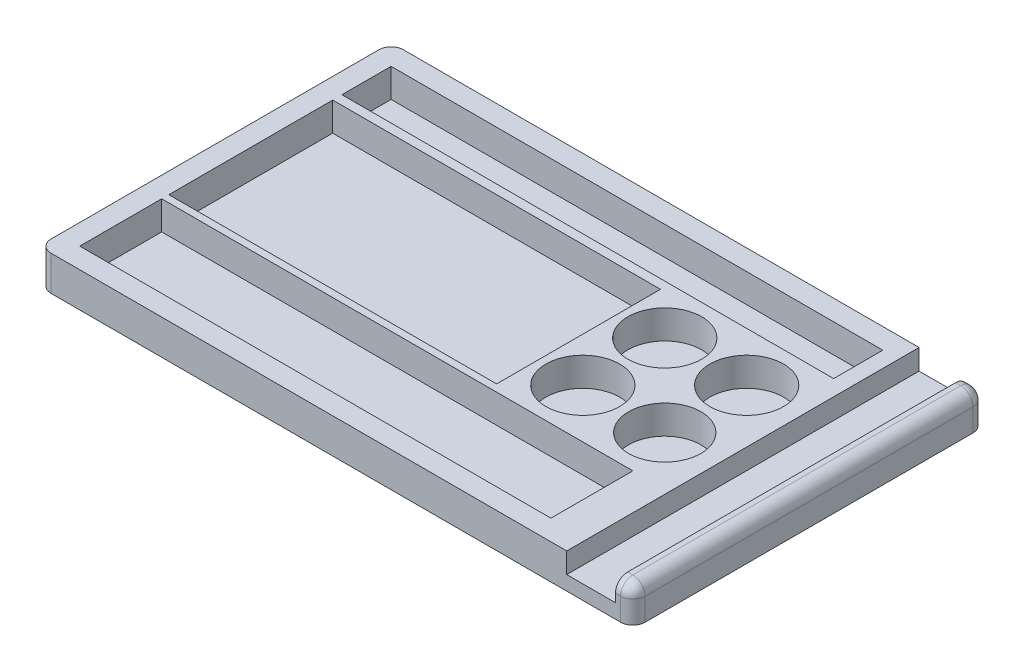
ISO-10303-21;
HEADER;
FILE_DESCRIPTION(('STEP AP214'),'2;1');
FILE_NAME('part.step','',(''),(''),'','','');
FILE_SCHEMA(('AUTOMOTIVE_DESIGN { 1 0 10303 214 1 1 1 1 }'));
ENDSEC;
DATA;
#1=APPLICATION_CONTEXT('core data for automotive mechanical design processes');
#2=APPLICATION_PROTOCOL_DEFINITION('international standard','automotive_design',2000,#1);
#3=PRODUCT_CONTEXT('',#1,'mechanical');
#4=PRODUCT('Part','Part','',(#3));
#5=PRODUCT_RELATED_PRODUCT_CATEGORY('part','',(#4));
#6=PRODUCT_DEFINITION_FORMATION('','',#4);
#7=PRODUCT_DEFINITION_CONTEXT('part definition',#1,'design');
#8=PRODUCT_DEFINITION('design','',#6,#7);
#9=PRODUCT_DEFINITION_SHAPE('','',#8);
#10=(LENGTH_UNIT() NAMED_UNIT(*) SI_UNIT(.MILLI.,.METRE.));
#11=(NAMED_UNIT(*) PLANE_ANGLE_UNIT() SI_UNIT($,.RADIAN.));
#12=(NAMED_UNIT(*) SI_UNIT($,.STERADIAN.) SOLID_ANGLE_UNIT());
#13=UNCERTAINTY_MEASURE_WITH_UNIT(LENGTH_MEASURE(1.E-05),#10,'distance_accuracy_value','');
#14=(GEOMETRIC_REPRESENTATION_CONTEXT(3) GLOBAL_UNCERTAINTY_ASSIGNED_CONTEXT((#13)) GLOBAL_UNIT_ASSIGNED_CONTEXT((#10,
#11,#12)) REPRESENTATION_CONTEXT('',''));
#15=CARTESIAN_POINT('',(0.,0.,0.));
#16=DIRECTION('',(0.,0.,1.));
#17=DIRECTION('',(1.,0.,0.));
#18=AXIS2_PLACEMENT_3D('',#15,#16,#17);
#19=CARTESIAN_POINT('',(0.,8.5,0.));
#20=DIRECTION('',(0.,-1.,0.));
#21=DIRECTION('',(0.,0.,-1.));
#22=AXIS2_PLACEMENT_3D('',#19,#20,#21);
#23=PLANE('',#22);
#24=DIRECTION('',(1.,0.,0.));
#25=VECTOR('',#24,1.);
#26=CARTESIAN_POINT('',(85.,8.5,-26.7409125329553));
#27=LINE('',#26,#25);
#28=CARTESIAN_POINT('',(5.,8.5,-26.7409125329553));
#29=VERTEX_POINT('',#28);
#30=CARTESIAN_POINT('',(85.,8.5,-26.7409125329553));
#31=VERTEX_POINT('',#30);
#32=EDGE_CURVE('E405',#29,#31,#27,.T.);
#33=ORIENTED_EDGE('',*,*,#32,.F.);
#34=DIRECTION('',(0.,0.,1.));
#35=VECTOR('',#34,1.);
#36=CARTESIAN_POINT('',(5.,8.5,-26.7409125329553));
#37=LINE('',#36,#35);
#38=CARTESIAN_POINT('',(5.,8.5,-66.7409125329553));
#39=VERTEX_POINT('',#38);
#40=EDGE_CURVE('E375',#39,#29,#37,.T.);
#41=ORIENTED_EDGE('',*,*,#40,.F.);
#42=DIRECTION('',(-1.,0.,0.));
#43=VECTOR('',#42,1.);
#44=CARTESIAN_POINT('',(85.,8.5,-66.7409125329553));
#45=LINE('',#44,#43);
#46=CARTESIAN_POINT('',(85.,8.5,-66.7409125329553));
#47=VERTEX_POINT('',#46);
#48=EDGE_CURVE('E390',#47,#39,#45,.T.);
#49=ORIENTED_EDGE('',*,*,#48,.F.);
#50=DIRECTION('',(0.,0.,-1.));
#51=VECTOR('',#50,1.);
#52=CARTESIAN_POINT('',(85.,8.5,-26.7409125329553));
#53=LINE('',#52,#51);
#54=EDGE_CURVE('E409',#31,#47,#53,.T.);
#55=ORIENTED_EDGE('',*,*,#54,.F.);
#56=EDGE_LOOP('',(#33,#41,#49,#55));
#57=FACE_BOUND('',#56,.T.);
#58=DIRECTION('',(1.,0.,0.));
#59=VECTOR('',#58,1.);
#60=CARTESIAN_POINT('',(120.,8.5,-5.));
#61=LINE('',#60,#59);
#62=CARTESIAN_POINT('',(5.,8.5,-4.99999999999999));
#63=VERTEX_POINT('',#62);
#64=CARTESIAN_POINT('',(120.,8.5,-5.));
#65=VERTEX_POINT('',#64);
#66=EDGE_CURVE('E361',#63,#65,#61,.T.);
#67=ORIENTED_EDGE('',*,*,#66,.F.);
#68=DIRECTION('',(0.,0.,1.));
#69=VECTOR('',#68,1.);
#70=CARTESIAN_POINT('',(5.,8.5,-4.99999999999999));
#71=LINE('',#70,#69);
#72=CARTESIAN_POINT('',(5.,8.5,-25.));
#73=VERTEX_POINT('',#72);
#74=EDGE_CURVE('E331',#73,#63,#71,.T.);
#75=ORIENTED_EDGE('',*,*,#74,.F.);
#76=DIRECTION('',(-1.,0.,0.));
#77=VECTOR('',#76,1.);
#78=CARTESIAN_POINT('',(120.,8.5,-25.));
#79=LINE('',#78,#77);
#80=CARTESIAN_POINT('',(120.,8.5,-25.));
#81=VERTEX_POINT('',#80);
#82=EDGE_CURVE('E346',#81,#73,#79,.T.);
#83=ORIENTED_EDGE('',*,*,#82,.F.);
#84=DIRECTION('',(0.,0.,-1.));
#85=VECTOR('',#84,1.);
#86=CARTESIAN_POINT('',(120.,8.5,-5.));
#87=LINE('',#86,#85);
#88=EDGE_CURVE('E365',#65,#81,#87,.T.);
#89=ORIENTED_EDGE('',*,*,#88,.F.);
#90=EDGE_LOOP('',(#67,#75,#83,#89));
#91=FACE_BOUND('',#90,.T.);
#92=DIRECTION('',(1.,0.,0.));
#93=VECTOR('',#92,1.);
#94=CARTESIAN_POINT('',(125.,8.5,-69.));
#95=LINE('',#94,#93);
#96=CARTESIAN_POINT('',(5.,8.5,-69.));
#97=VERTEX_POINT('',#96);
#98=CARTESIAN_POINT('',(125.,8.5,-69.));
#99=VERTEX_POINT('',#98);
#100=EDGE_CURVE('E317',#97,#99,#95,.T.);
#101=ORIENTED_EDGE('',*,*,#100,.F.);
#102=DIRECTION('',(0.,0.,1.));
#103=VECTOR('',#102,1.);
#104=CARTESIAN_POINT('',(5.,8.5,-69.));
#105=LINE('',#104,#103);
#106=CARTESIAN_POINT('',(5.,8.5,-81.));
#107=VERTEX_POINT('',#106);
#108=EDGE_CURVE('E293',#107,#97,#105,.T.);
#109=ORIENTED_EDGE('',*,*,#108,.F.);
#110=DIRECTION('',(-1.,0.,0.));
#111=VECTOR('',#110,1.);
#112=CARTESIAN_POINT('',(125.,8.5,-81.));
#113=LINE('',#112,#111);
#114=CARTESIAN_POINT('',(125.,8.5,-81.));
#115=VERTEX_POINT('',#114);
#116=EDGE_CURVE('E302',#115,#107,#113,.T.);
#117=ORIENTED_EDGE('',*,*,#116,.F.);
#118=DIRECTION('',(0.,0.,-1.));
#119=VECTOR('',#118,1.);
#120=CARTESIAN_POINT('',(125.,8.5,-69.));
#121=LINE('',#120,#119);
#122=EDGE_CURVE('E321',#99,#115,#121,.T.);
#123=ORIENTED_EDGE('',*,*,#122,.F.);
#124=EDGE_LOOP('',(#101,#109,#117,#123));
#125=FACE_BOUND('',#124,.T.);
#126=CARTESIAN_POINT('',(95.8072207463572,8.5,-36.9756660286289));
#127=DIRECTION('',(0.,1.,0.));
#128=DIRECTION('',(0.,0.,1.));
#129=AXIS2_PLACEMENT_3D('',#126,#127,#128);
#130=CIRCLE('',#129,9.);
#131=CARTESIAN_POINT('',(95.8072207463572,8.5,-27.9756660286289));
#132=VERTEX_POINT('',#131);
#133=EDGE_CURVE('E277',#132,#132,#130,.T.);
#134=ORIENTED_EDGE('',*,*,#133,.F.);
#135=EDGE_LOOP('',(#134));
#136=FACE_BOUND('',#135,.T.);
#137=CARTESIAN_POINT('',(115.807220746357,8.5,-56.9756660286289));
#138=DIRECTION('',(0.,1.,0.));
#139=DIRECTION('',(0.,0.,1.));
#140=AXIS2_PLACEMENT_3D('',#137,#138,#139);
#141=CIRCLE('',#140,9.00000000000002);
#142=CARTESIAN_POINT('',(115.807220746357,8.5,-47.9756660286289));
#143=VERTEX_POINT('',#142);
#144=EDGE_CURVE('E258',#143,#143,#141,.T.);
#145=ORIENTED_EDGE('',*,*,#144,.F.);
#146=EDGE_LOOP('',(#145));
#147=FACE_BOUND('',#146,.T.);
#148=CARTESIAN_POINT('',(95.8072207463572,8.5,-56.9756660286289));
#149=DIRECTION('',(0.,1.,0.));
#150=DIRECTION('',(0.,0.,1.));
#151=AXIS2_PLACEMENT_3D('',#148,#149,#150);
#152=CIRCLE('',#151,9.);
#153=CARTESIAN_POINT('',(95.8072207463572,8.5,-47.9756660286289));
#154=VERTEX_POINT('',#153);
#155=EDGE_CURVE('E269',#154,#154,#152,.T.);
#156=ORIENTED_EDGE('',*,*,#155,.F.);
#157=EDGE_LOOP('',(#156));
#158=FACE_BOUND('',#157,.T.);
#159=CARTESIAN_POINT('',(115.807220746357,8.5,-36.9756660286289));
#160=DIRECTION('',(0.,1.,0.));
#161=DIRECTION('',(0.,0.,1.));
#162=AXIS2_PLACEMENT_3D('',#159,#160,#161);
#163=CIRCLE('',#162,8.83129830477136);
#164=CARTESIAN_POINT('',(115.807220746357,8.5,-28.1443677238575));
#165=VERTEX_POINT('',#164);
#166=EDGE_CURVE('E278',#165,#165,#163,.T.);
#167=ORIENTED_EDGE('',*,*,#166,.F.);
#168=EDGE_LOOP('',(#167));
#169=FACE_BOUND('',#168,.T.);
#170=DIRECTION('',(-1.,0.,0.));
#171=VECTOR('',#170,1.);
#172=CARTESIAN_POINT('',(0.,8.5,-86.));
#173=LINE('',#172,#171);
#174=CARTESIAN_POINT('',(128.856380158185,8.5,-86.));
#175=VERTEX_POINT('',#174);
#176=CARTESIAN_POINT('',(3.,8.5,-86.));
#177=VERTEX_POINT('',#176);
#178=EDGE_CURVE('E436',#175,#177,#173,.T.);
#179=ORIENTED_EDGE('',*,*,#178,.T.);
#180=CARTESIAN_POINT('',(3.,8.5,-83.));
#181=DIRECTION('',(0.,-1.,0.));
#182=DIRECTION('',(0.,0.,-1.));
#183=AXIS2_PLACEMENT_3D('',#180,#181,#182);
#184=CIRCLE('',#183,3.);
#185=CARTESIAN_POINT('',(0.,8.5,-83.));
#186=VERTEX_POINT('',#185);
#187=EDGE_CURVE('E11',#177,#186,#184,.F.);
#188=ORIENTED_EDGE('',*,*,#187,.T.);
#189=DIRECTION('',(0.,0.,1.));
#190=VECTOR('',#189,1.);
#191=CARTESIAN_POINT('',(0.,8.5,0.));
#192=LINE('',#191,#190);
#193=CARTESIAN_POINT('',(0.,8.5,-3.));
#194=VERTEX_POINT('',#193);
#195=EDGE_CURVE('E429',#186,#194,#192,.T.);
#196=ORIENTED_EDGE('',*,*,#195,.T.);
#197=CARTESIAN_POINT('',(3.,8.5,-3.));
#198=DIRECTION('',(0.,-1.,0.));
#199=DIRECTION('',(0.,0.,-1.));
#200=AXIS2_PLACEMENT_3D('',#197,#198,#199);
#201=CIRCLE('',#200,3.);
#202=CARTESIAN_POINT('',(3.,8.5,0.));
#203=VERTEX_POINT('',#202);
#204=EDGE_CURVE('E529',#194,#203,#201,.F.);
#205=ORIENTED_EDGE('',*,*,#204,.T.);
#206=DIRECTION('',(1.,0.,0.));
#207=VECTOR('',#206,1.);
#208=CARTESIAN_POINT('',(0.,8.5,0.));
#209=LINE('',#208,#207);
#210=CARTESIAN_POINT('',(128.856380158185,8.5,0.));
#211=VERTEX_POINT('',#210);
#212=EDGE_CURVE('E432',#203,#211,#209,.T.);
#213=ORIENTED_EDGE('',*,*,#212,.T.);
#214=DIRECTION('',(0.,0.,1.));
#215=VECTOR('',#214,1.);
#216=CARTESIAN_POINT('',(128.856380158185,8.5,-86.));
#217=LINE('',#216,#215);
#218=EDGE_CURVE('E220',#175,#211,#217,.T.);
#219=ORIENTED_EDGE('',*,*,#218,.F.);
#220=EDGE_LOOP('',(#179,#188,#196,#205,#213,#219));
#221=FACE_BOUND('',#220,.T.);
#222=ADVANCED_FACE('F40',(#57,#91,#125,#136,#147,#158,#169,#221),#23,.F.);
#223=CARTESIAN_POINT('',(0.,8.5,0.));
#224=DIRECTION('',(1.,0.,0.));
#225=DIRECTION('',(0.,0.,-1.));
#226=AXIS2_PLACEMENT_3D('',#223,#224,#225);
#227=PLANE('',#226);
#228=ORIENTED_EDGE('',*,*,#195,.F.);
#229=DIRECTION('',(0.,-1.,0.));
#230=VECTOR('',#229,1.);
#231=CARTESIAN_POINT('',(0.,8.5,-83.));
#232=LINE('',#231,#230);
#233=CARTESIAN_POINT('',(0.,0.,-83.));
#234=VERTEX_POINT('',#233);
#235=EDGE_CURVE('E532',#186,#234,#232,.T.);
#236=ORIENTED_EDGE('',*,*,#235,.T.);
#237=DIRECTION('',(0.,0.,1.));
#238=VECTOR('',#237,1.);
#239=CARTESIAN_POINT('',(0.,0.,0.));
#240=LINE('',#239,#238);
#241=CARTESIAN_POINT('',(0.,0.,-3.));
#242=VERTEX_POINT('',#241);
#243=EDGE_CURVE('E419',#234,#242,#240,.T.);
#244=ORIENTED_EDGE('',*,*,#243,.T.);
#245=DIRECTION('',(0.,-1.,0.));
#246=VECTOR('',#245,1.);
#247=CARTESIAN_POINT('',(0.,8.5,-3.));
#248=LINE('',#247,#246);
#249=EDGE_CURVE('E525',#242,#194,#248,.F.);
#250=ORIENTED_EDGE('',*,*,#249,.T.);
#251=EDGE_LOOP('',(#228,#236,#244,#250));
#252=FACE_BOUND('',#251,.T.);
#253=ADVANCED_FACE('F541',(#252),#227,.F.);
#254=CARTESIAN_POINT('',(0.,8.5,0.));
#255=DIRECTION('',(0.,0.,-1.));
#256=DIRECTION('',(-1.,0.,0.));
#257=AXIS2_PLACEMENT_3D('',#254,#255,#256);
#258=PLANE('',#257);
#259=ORIENTED_EDGE('',*,*,#212,.F.);
#260=DIRECTION('',(0.,-1.,0.));
#261=VECTOR('',#260,1.);
#262=CARTESIAN_POINT('',(3.,8.5,0.));
#263=LINE('',#262,#261);
#264=CARTESIAN_POINT('',(3.,0.,0.));
#265=VERTEX_POINT('',#264);
#266=EDGE_CURVE('E510',#203,#265,#263,.T.);
#267=ORIENTED_EDGE('',*,*,#266,.T.);
#268=DIRECTION('',(1.,0.,0.));
#269=VECTOR('',#268,1.);
#270=CARTESIAN_POINT('',(0.,0.,0.));
#271=LINE('',#270,#269);
#272=CARTESIAN_POINT('',(142.,0.,0.));
#273=VERTEX_POINT('',#272);
#274=EDGE_CURVE('E442',#265,#273,#271,.T.);
#275=ORIENTED_EDGE('',*,*,#274,.T.);
#276=DIRECTION('',(0.,-1.,0.));
#277=VECTOR('',#276,1.);
#278=CARTESIAN_POINT('',(142.,8.5,0.));
#279=LINE('',#278,#277);
#280=CARTESIAN_POINT('',(142.,5.5,0.));
#281=VERTEX_POINT('',#280);
#282=EDGE_CURVE('E461',#273,#281,#279,.F.);
#283=ORIENTED_EDGE('',*,*,#282,.T.);
#284=DIRECTION('',(1.,0.,0.));
#285=VECTOR('',#284,1.);
#286=CARTESIAN_POINT('',(0.,5.5,0.));
#287=LINE('',#286,#285);
#288=CARTESIAN_POINT('',(140.744054097803,5.5,0.));
#289=VERTEX_POINT('',#288);
#290=EDGE_CURVE('E464',#281,#289,#287,.F.);
#291=ORIENTED_EDGE('',*,*,#290,.T.);
#292=DIRECTION('',(0.,1.,0.));
#293=VECTOR('',#292,1.);
#294=CARTESIAN_POINT('',(140.744054097803,3.5,0.));
#295=LINE('',#294,#293);
#296=CARTESIAN_POINT('',(140.744054097803,3.5,0.));
#297=VERTEX_POINT('',#296);
#298=EDGE_CURVE('E225',#297,#289,#295,.T.);
#299=ORIENTED_EDGE('',*,*,#298,.F.);
#300=DIRECTION('',(1.,0.,0.));
#301=VECTOR('',#300,1.);
#302=CARTESIAN_POINT('',(128.856380158185,3.5,0.));
#303=LINE('',#302,#301);
#304=CARTESIAN_POINT('',(128.856380158185,3.5,0.));
#305=VERTEX_POINT('',#304);
#306=EDGE_CURVE('E232',#305,#297,#303,.T.);
#307=ORIENTED_EDGE('',*,*,#306,.F.);
#308=DIRECTION('',(0.,1.,0.));
#309=VECTOR('',#308,1.);
#310=CARTESIAN_POINT('',(128.856380158185,3.5,0.));
#311=LINE('',#310,#309);
#312=EDGE_CURVE('E214',#305,#211,#311,.T.);
#313=ORIENTED_EDGE('',*,*,#312,.T.);
#314=EDGE_LOOP('',(#259,#267,#275,#283,#291,#299,#307,#313));
#315=FACE_BOUND('',#314,.T.);
#316=ADVANCED_FACE('F239',(#315),#258,.F.);
#317=CARTESIAN_POINT('',(145.,8.5,0.));
#318=DIRECTION('',(-1.,0.,0.));
#319=DIRECTION('',(0.,0.,1.));
#320=AXIS2_PLACEMENT_3D('',#317,#318,#319);
#321=PLANE('',#320);
#322=DIRECTION('',(0.,0.,-1.));
#323=VECTOR('',#322,1.);
#324=CARTESIAN_POINT('',(145.,0.,0.));
#325=LINE('',#324,#323);
#326=CARTESIAN_POINT('',(145.,0.,-3.));
#327=VERTEX_POINT('',#326);
#328=CARTESIAN_POINT('',(145.,0.,-83.));
#329=VERTEX_POINT('',#328);
#330=EDGE_CURVE('E445',#327,#329,#325,.T.);
#331=ORIENTED_EDGE('',*,*,#330,.T.);
#332=DIRECTION('',(0.,-1.,0.));
#333=VECTOR('',#332,1.);
#334=CARTESIAN_POINT('',(145.,8.5,-83.));
#335=LINE('',#334,#333);
#336=CARTESIAN_POINT('',(145.,5.5,-83.));
#337=VERTEX_POINT('',#336);
#338=EDGE_CURVE('E507',#329,#337,#335,.F.);
#339=ORIENTED_EDGE('',*,*,#338,.T.);
#340=DIRECTION('',(0.,0.,-1.));
#341=VECTOR('',#340,1.);
#342=CARTESIAN_POINT('',(145.,5.5,0.));
#343=LINE('',#342,#341);
#344=CARTESIAN_POINT('',(145.,5.5,-3.));
#345=VERTEX_POINT('',#344);
#346=EDGE_CURVE('E454',#337,#345,#343,.F.);
#347=ORIENTED_EDGE('',*,*,#346,.T.);
#348=DIRECTION('',(0.,-1.,0.));
#349=VECTOR('',#348,1.);
#350=CARTESIAN_POINT('',(145.,8.5,-3.));
#351=LINE('',#350,#349);
#352=EDGE_CURVE('E474',#345,#327,#351,.T.);
#353=ORIENTED_EDGE('',*,*,#352,.T.);
#354=EDGE_LOOP('',(#331,#339,#347,#353));
#355=FACE_BOUND('',#354,.T.);
#356=ADVANCED_FACE('F611',(#355),#321,.F.);
#357=CARTESIAN_POINT('',(0.,8.5,-86.));
#358=DIRECTION('',(0.,0.,1.));
#359=DIRECTION('',(1.,0.,0.));
#360=AXIS2_PLACEMENT_3D('',#357,#358,#359);
#361=PLANE('',#360);
#362=DIRECTION('',(-1.,0.,0.));
#363=VECTOR('',#362,1.);
#364=CARTESIAN_POINT('',(0.,0.,-86.));
#365=LINE('',#364,#363);
#366=CARTESIAN_POINT('',(142.,0.,-86.));
#367=VERTEX_POINT('',#366);
#368=CARTESIAN_POINT('',(3.,0.,-86.));
#369=VERTEX_POINT('',#368);
#370=EDGE_CURVE('E433',#367,#369,#365,.T.);
#371=ORIENTED_EDGE('',*,*,#370,.T.);
#372=DIRECTION('',(0.,-1.,0.));
#373=VECTOR('',#372,1.);
#374=CARTESIAN_POINT('',(3.,8.5,-86.));
#375=LINE('',#374,#373);
#376=EDGE_CURVE('E49',#369,#177,#375,.F.);
#377=ORIENTED_EDGE('',*,*,#376,.T.);
#378=ORIENTED_EDGE('',*,*,#178,.F.);
#379=DIRECTION('',(0.,1.,0.));
#380=VECTOR('',#379,1.);
#381=CARTESIAN_POINT('',(128.856380158185,3.5,-86.));
#382=LINE('',#381,#380);
#383=CARTESIAN_POINT('',(128.856380158185,3.5,-86.));
#384=VERTEX_POINT('',#383);
#385=EDGE_CURVE('E255',#384,#175,#382,.T.);
#386=ORIENTED_EDGE('',*,*,#385,.F.);
#387=DIRECTION('',(-1.,0.,0.));
#388=VECTOR('',#387,1.);
#389=CARTESIAN_POINT('',(128.856380158185,3.5,-86.));
#390=LINE('',#389,#388);
#391=CARTESIAN_POINT('',(140.744054097803,3.5,-86.));
#392=VERTEX_POINT('',#391);
#393=EDGE_CURVE('E226',#392,#384,#390,.T.);
#394=ORIENTED_EDGE('',*,*,#393,.F.);
#395=DIRECTION('',(0.,1.,0.));
#396=VECTOR('',#395,1.);
#397=CARTESIAN_POINT('',(140.744054097803,3.5,-86.));
#398=LINE('',#397,#396);
#399=CARTESIAN_POINT('',(140.744054097803,5.5,-86.));
#400=VERTEX_POINT('',#399);
#401=EDGE_CURVE('E259',#392,#400,#398,.T.);
#402=ORIENTED_EDGE('',*,*,#401,.T.);
#403=DIRECTION('',(-1.,0.,0.));
#404=VECTOR('',#403,1.);
#405=CARTESIAN_POINT('',(0.,5.5,-86.));
#406=LINE('',#405,#404);
#407=CARTESIAN_POINT('',(142.,5.5,-86.));
#408=VERTEX_POINT('',#407);
#409=EDGE_CURVE('E498',#400,#408,#406,.F.);
#410=ORIENTED_EDGE('',*,*,#409,.T.);
#411=DIRECTION('',(0.,-1.,0.));
#412=VECTOR('',#411,1.);
#413=CARTESIAN_POINT('',(142.,8.5,-86.));
#414=LINE('',#413,#412);
#415=EDGE_CURVE('E495',#408,#367,#414,.T.);
#416=ORIENTED_EDGE('',*,*,#415,.T.);
#417=EDGE_LOOP('',(#371,#377,#378,#386,#394,#402,#410,#416));
#418=FACE_BOUND('',#417,.T.);
#419=ADVANCED_FACE('F586',(#418),#361,.F.);
#420=DIRECTION('',(0.,0.,-1.));
#421=VECTOR('',#420,1.);
#422=CARTESIAN_POINT('',(142.,8.5,0.));
#423=LINE('',#422,#421);
#424=CARTESIAN_POINT('',(142.,8.5,-3.));
#425=VERTEX_POINT('',#424);
#426=CARTESIAN_POINT('',(142.,8.5,-83.));
#427=VERTEX_POINT('',#426);
#428=EDGE_CURVE('E439',#425,#427,#423,.T.);
#429=ORIENTED_EDGE('',*,*,#428,.T.);
#430=DIRECTION('',(-1.,0.,0.));
#431=VECTOR('',#430,1.);
#432=CARTESIAN_POINT('',(0.,8.5,-83.));
#433=LINE('',#432,#431);
#434=CARTESIAN_POINT('',(140.744054097803,8.5,-83.));
#435=VERTEX_POINT('',#434);
#436=EDGE_CURVE('E481',#427,#435,#433,.T.);
#437=ORIENTED_EDGE('',*,*,#436,.T.);
#438=DIRECTION('',(0.,0.,-1.));
#439=VECTOR('',#438,1.);
#440=CARTESIAN_POINT('',(140.744054097803,8.5,-86.));
#441=LINE('',#440,#439);
#442=CARTESIAN_POINT('',(140.744054097803,8.5,-3.));
#443=VERTEX_POINT('',#442);
#444=EDGE_CURVE('E237',#443,#435,#441,.T.);
#445=ORIENTED_EDGE('',*,*,#444,.F.);
#446=DIRECTION('',(1.,0.,0.));
#447=VECTOR('',#446,1.);
#448=CARTESIAN_POINT('',(0.,8.5,-3.));
#449=LINE('',#448,#447);
#450=EDGE_CURVE('E457',#443,#425,#449,.T.);
#451=ORIENTED_EDGE('',*,*,#450,.T.);
#452=EDGE_LOOP('',(#429,#437,#445,#451));
#453=FACE_BOUND('',#452,.T.);
#454=ADVANCED_FACE('F573',(#453),#23,.F.);
#455=CARTESIAN_POINT('',(0.,0.,0.));
#456=DIRECTION('',(0.,-1.,0.));
#457=DIRECTION('',(0.,0.,-1.));
#458=AXIS2_PLACEMENT_3D('',#455,#456,#457);
#459=PLANE('',#458);
#460=ORIENTED_EDGE('',*,*,#243,.F.);
#461=CARTESIAN_POINT('',(3.,0.,-83.));
#462=DIRECTION('',(0.,-1.,0.));
#463=DIRECTION('',(0.,0.,-1.));
#464=AXIS2_PLACEMENT_3D('',#461,#462,#463);
#465=CIRCLE('',#464,3.);
#466=EDGE_CURVE('E63',#234,#369,#465,.T.);
#467=ORIENTED_EDGE('',*,*,#466,.T.);
#468=ORIENTED_EDGE('',*,*,#370,.F.);
#469=CARTESIAN_POINT('',(142.,0.,-83.));
#470=DIRECTION('',(0.,-1.,0.));
#471=DIRECTION('',(0.,0.,-1.));
#472=AXIS2_PLACEMENT_3D('',#469,#470,#471);
#473=CIRCLE('',#472,3.);
#474=EDGE_CURVE('E504',#367,#329,#473,.T.);
#475=ORIENTED_EDGE('',*,*,#474,.T.);
#476=ORIENTED_EDGE('',*,*,#330,.F.);
#477=CARTESIAN_POINT('',(142.,0.,-3.));
#478=DIRECTION('',(0.,-1.,0.));
#479=DIRECTION('',(0.,0.,-1.));
#480=AXIS2_PLACEMENT_3D('',#477,#478,#479);
#481=CIRCLE('',#480,3.);
#482=EDGE_CURVE('E477',#327,#273,#481,.T.);
#483=ORIENTED_EDGE('',*,*,#482,.T.);
#484=ORIENTED_EDGE('',*,*,#274,.F.);
#485=CARTESIAN_POINT('',(3.,0.,-3.));
#486=DIRECTION('',(0.,-1.,0.));
#487=DIRECTION('',(0.,0.,-1.));
#488=AXIS2_PLACEMENT_3D('',#485,#486,#487);
#489=CIRCLE('',#488,3.);
#490=EDGE_CURVE('E521',#265,#242,#489,.T.);
#491=ORIENTED_EDGE('',*,*,#490,.T.);
#492=EDGE_LOOP('',(#460,#467,#468,#475,#476,#483,#484,#491));
#493=FACE_BOUND('',#492,.T.);
#494=ADVANCED_FACE('F544',(#493),#459,.T.);
#495=CARTESIAN_POINT('',(5.,1.5,-26.7409125329553));
#496=DIRECTION('',(-1.,0.,0.));
#497=DIRECTION('',(0.,0.,1.));
#498=AXIS2_PLACEMENT_3D('',#495,#496,#497);
#499=PLANE('',#498);
#500=ORIENTED_EDGE('',*,*,#40,.T.);
#501=DIRECTION('',(0.,1.,0.));
#502=VECTOR('',#501,1.);
#503=CARTESIAN_POINT('',(5.,1.5,-26.7409125329553));
#504=LINE('',#503,#502);
#505=CARTESIAN_POINT('',(5.,1.5,-26.7409125329553));
#506=VERTEX_POINT('',#505);
#507=EDGE_CURVE('E402',#506,#29,#504,.T.);
#508=ORIENTED_EDGE('',*,*,#507,.F.);
#509=DIRECTION('',(0.,0.,1.));
#510=VECTOR('',#509,1.);
#511=CARTESIAN_POINT('',(5.,1.5,-26.7409125329553));
#512=LINE('',#511,#510);
#513=CARTESIAN_POINT('',(5.,1.5,-66.7409125329553));
#514=VERTEX_POINT('',#513);
#515=EDGE_CURVE('E385',#514,#506,#512,.T.);
#516=ORIENTED_EDGE('',*,*,#515,.F.);
#517=DIRECTION('',(0.,1.,0.));
#518=VECTOR('',#517,1.);
#519=CARTESIAN_POINT('',(5.,1.5,-66.7409125329553));
#520=LINE('',#519,#518);
#521=EDGE_CURVE('E416',#514,#39,#520,.T.);
#522=ORIENTED_EDGE('',*,*,#521,.T.);
#523=EDGE_LOOP('',(#500,#508,#516,#522));
#524=FACE_BOUND('',#523,.T.);
#525=ADVANCED_FACE('F609',(#524),#499,.F.);
#526=CARTESIAN_POINT('',(85.,1.5,-66.7409125329553));
#527=DIRECTION('',(0.,0.,-1.));
#528=DIRECTION('',(-1.,0.,0.));
#529=AXIS2_PLACEMENT_3D('',#526,#527,#528);
#530=PLANE('',#529);
#531=ORIENTED_EDGE('',*,*,#48,.T.);
#532=ORIENTED_EDGE('',*,*,#521,.F.);
#533=DIRECTION('',(-1.,0.,0.));
#534=VECTOR('',#533,1.);
#535=CARTESIAN_POINT('',(85.,1.5,-66.7409125329553));
#536=LINE('',#535,#534);
#537=CARTESIAN_POINT('',(85.,1.5,-66.7409125329553));
#538=VERTEX_POINT('',#537);
#539=EDGE_CURVE('E398',#538,#514,#536,.T.);
#540=ORIENTED_EDGE('',*,*,#539,.F.);
#541=DIRECTION('',(0.,1.,0.));
#542=VECTOR('',#541,1.);
#543=CARTESIAN_POINT('',(85.,1.5,-66.7409125329553));
#544=LINE('',#543,#542);
#545=EDGE_CURVE('E420',#538,#47,#544,.T.);
#546=ORIENTED_EDGE('',*,*,#545,.T.);
#547=EDGE_LOOP('',(#531,#532,#540,#546));
#548=FACE_BOUND('',#547,.T.);
#549=ADVANCED_FACE('F693',(#548),#530,.F.);
#550=CARTESIAN_POINT('',(85.,1.5,-26.7409125329553));
#551=DIRECTION('',(1.,0.,0.));
#552=DIRECTION('',(0.,0.,-1.));
#553=AXIS2_PLACEMENT_3D('',#550,#551,#552);
#554=PLANE('',#553);
#555=ORIENTED_EDGE('',*,*,#54,.T.);
#556=ORIENTED_EDGE('',*,*,#545,.F.);
#557=DIRECTION('',(0.,0.,-1.));
#558=VECTOR('',#557,1.);
#559=CARTESIAN_POINT('',(85.,1.5,-26.7409125329553));
#560=LINE('',#559,#558);
#561=CARTESIAN_POINT('',(85.,1.5,-26.7409125329553));
#562=VERTEX_POINT('',#561);
#563=EDGE_CURVE('E394',#562,#538,#560,.T.);
#564=ORIENTED_EDGE('',*,*,#563,.F.);
#565=DIRECTION('',(0.,1.,0.));
#566=VECTOR('',#565,1.);
#567=CARTESIAN_POINT('',(85.,1.5,-26.7409125329553));
#568=LINE('',#567,#566);
#569=EDGE_CURVE('E423',#562,#31,#568,.T.);
#570=ORIENTED_EDGE('',*,*,#569,.T.);
#571=EDGE_LOOP('',(#555,#556,#564,#570));
#572=FACE_BOUND('',#571,.T.);
#573=ADVANCED_FACE('F699',(#572),#554,.F.);
#574=CARTESIAN_POINT('',(85.,1.5,-26.7409125329553));
#575=DIRECTION('',(0.,0.,1.));
#576=DIRECTION('',(1.,0.,0.));
#577=AXIS2_PLACEMENT_3D('',#574,#575,#576);
#578=PLANE('',#577);
#579=ORIENTED_EDGE('',*,*,#32,.T.);
#580=ORIENTED_EDGE('',*,*,#569,.F.);
#581=DIRECTION('',(1.,0.,0.));
#582=VECTOR('',#581,1.);
#583=CARTESIAN_POINT('',(85.,1.5,-26.7409125329553));
#584=LINE('',#583,#582);
#585=EDGE_CURVE('E389',#506,#562,#584,.T.);
#586=ORIENTED_EDGE('',*,*,#585,.F.);
#587=ORIENTED_EDGE('',*,*,#507,.T.);
#588=EDGE_LOOP('',(#579,#580,#586,#587));
#589=FACE_BOUND('',#588,.T.);
#590=ADVANCED_FACE('F707',(#589),#578,.F.);
#591=CARTESIAN_POINT('',(0.,1.5,0.));
#592=DIRECTION('',(0.,1.,0.));
#593=DIRECTION('',(0.,0.,1.));
#594=AXIS2_PLACEMENT_3D('',#591,#592,#593);
#595=PLANE('',#594);
#596=ORIENTED_EDGE('',*,*,#515,.T.);
#597=ORIENTED_EDGE('',*,*,#585,.T.);
#598=ORIENTED_EDGE('',*,*,#563,.T.);
#599=ORIENTED_EDGE('',*,*,#539,.T.);
#600=EDGE_LOOP('',(#596,#597,#598,#599));
#601=FACE_BOUND('',#600,.T.);
#602=ADVANCED_FACE('F715',(#601),#595,.T.);
#603=CARTESIAN_POINT('',(5.,1.5,-4.99999999999999));
#604=DIRECTION('',(-1.,0.,0.));
#605=DIRECTION('',(0.,0.,1.));
#606=AXIS2_PLACEMENT_3D('',#603,#604,#605);
#607=PLANE('',#606);
#608=ORIENTED_EDGE('',*,*,#74,.T.);
#609=DIRECTION('',(0.,1.,0.));
#610=VECTOR('',#609,1.);
#611=CARTESIAN_POINT('',(5.,1.5,-4.99999999999999));
#612=LINE('',#611,#610);
#613=CARTESIAN_POINT('',(5.,1.5,-4.99999999999999));
#614=VERTEX_POINT('',#613);
#615=EDGE_CURVE('E358',#614,#63,#612,.T.);
#616=ORIENTED_EDGE('',*,*,#615,.F.);
#617=DIRECTION('',(0.,0.,1.));
#618=VECTOR('',#617,1.);
#619=CARTESIAN_POINT('',(5.,1.5,-4.99999999999999));
#620=LINE('',#619,#618);
#621=CARTESIAN_POINT('',(5.,1.5,-25.));
#622=VERTEX_POINT('',#621);
#623=EDGE_CURVE('E341',#622,#614,#620,.T.);
#624=ORIENTED_EDGE('',*,*,#623,.F.);
#625=DIRECTION('',(0.,1.,0.));
#626=VECTOR('',#625,1.);
#627=CARTESIAN_POINT('',(5.,1.5,-25.));
#628=LINE('',#627,#626);
#629=EDGE_CURVE('E372',#622,#73,#628,.T.);
#630=ORIENTED_EDGE('',*,*,#629,.T.);
#631=EDGE_LOOP('',(#608,#616,#624,#630));
#632=FACE_BOUND('',#631,.T.);
#633=ADVANCED_FACE('F723',(#632),#607,.F.);
#634=CARTESIAN_POINT('',(120.,1.5,-25.));
#635=DIRECTION('',(0.,0.,-1.));
#636=DIRECTION('',(-1.,0.,0.));
#637=AXIS2_PLACEMENT_3D('',#634,#635,#636);
#638=PLANE('',#637);
#639=ORIENTED_EDGE('',*,*,#82,.T.);
#640=ORIENTED_EDGE('',*,*,#629,.F.);
#641=DIRECTION('',(-1.,0.,0.));
#642=VECTOR('',#641,1.);
#643=CARTESIAN_POINT('',(120.,1.5,-25.));
#644=LINE('',#643,#642);
#645=CARTESIAN_POINT('',(120.,1.5,-25.));
#646=VERTEX_POINT('',#645);
#647=EDGE_CURVE('E354',#646,#622,#644,.T.);
#648=ORIENTED_EDGE('',*,*,#647,.F.);
#649=DIRECTION('',(0.,1.,0.));
#650=VECTOR('',#649,1.);
#651=CARTESIAN_POINT('',(120.,1.5,-25.));
#652=LINE('',#651,#650);
#653=EDGE_CURVE('E376',#646,#81,#652,.T.);
#654=ORIENTED_EDGE('',*,*,#653,.T.);
#655=EDGE_LOOP('',(#639,#640,#648,#654));
#656=FACE_BOUND('',#655,.T.);
#657=ADVANCED_FACE('F731',(#656),#638,.F.);
#658=CARTESIAN_POINT('',(120.,1.5,-5.));
#659=DIRECTION('',(1.,0.,0.));
#660=DIRECTION('',(0.,0.,-1.));
#661=AXIS2_PLACEMENT_3D('',#658,#659,#660);
#662=PLANE('',#661);
#663=ORIENTED_EDGE('',*,*,#88,.T.);
#664=ORIENTED_EDGE('',*,*,#653,.F.);
#665=DIRECTION('',(0.,0.,-1.));
#666=VECTOR('',#665,1.);
#667=CARTESIAN_POINT('',(120.,1.5,-5.));
#668=LINE('',#667,#666);
#669=CARTESIAN_POINT('',(120.,1.5,-5.));
#670=VERTEX_POINT('',#669);
#671=EDGE_CURVE('E350',#670,#646,#668,.T.);
#672=ORIENTED_EDGE('',*,*,#671,.F.);
#673=DIRECTION('',(0.,1.,0.));
#674=VECTOR('',#673,1.);
#675=CARTESIAN_POINT('',(120.,1.5,-5.));
#676=LINE('',#675,#674);
#677=EDGE_CURVE('E379',#670,#65,#676,.T.);
#678=ORIENTED_EDGE('',*,*,#677,.T.);
#679=EDGE_LOOP('',(#663,#664,#672,#678));
#680=FACE_BOUND('',#679,.T.);
#681=ADVANCED_FACE('F739',(#680),#662,.F.);
#682=CARTESIAN_POINT('',(120.,1.5,-5.));
#683=DIRECTION('',(0.,0.,1.));
#684=DIRECTION('',(1.,0.,0.));
#685=AXIS2_PLACEMENT_3D('',#682,#683,#684);
#686=PLANE('',#685);
#687=ORIENTED_EDGE('',*,*,#66,.T.);
#688=ORIENTED_EDGE('',*,*,#677,.F.);
#689=DIRECTION('',(1.,0.,0.));
#690=VECTOR('',#689,1.);
#691=CARTESIAN_POINT('',(120.,1.5,-5.));
#692=LINE('',#691,#690);
#693=EDGE_CURVE('E345',#614,#670,#692,.T.);
#694=ORIENTED_EDGE('',*,*,#693,.F.);
#695=ORIENTED_EDGE('',*,*,#615,.T.);
#696=EDGE_LOOP('',(#687,#688,#694,#695));
#697=FACE_BOUND('',#696,.T.);
#698=ADVANCED_FACE('F747',(#697),#686,.F.);
#699=CARTESIAN_POINT('',(0.,1.5,0.));
#700=DIRECTION('',(0.,1.,0.));
#701=DIRECTION('',(0.,0.,1.));
#702=AXIS2_PLACEMENT_3D('',#699,#700,#701);
#703=PLANE('',#702);
#704=ORIENTED_EDGE('',*,*,#623,.T.);
#705=ORIENTED_EDGE('',*,*,#693,.T.);
#706=ORIENTED_EDGE('',*,*,#671,.T.);
#707=ORIENTED_EDGE('',*,*,#647,.T.);
#708=EDGE_LOOP('',(#704,#705,#706,#707));
#709=FACE_BOUND('',#708,.T.);
#710=ADVANCED_FACE('F755',(#709),#703,.T.);
#711=CARTESIAN_POINT('',(5.,1.5,-69.));
#712=DIRECTION('',(-1.,0.,0.));
#713=DIRECTION('',(0.,0.,1.));
#714=AXIS2_PLACEMENT_3D('',#711,#712,#713);
#715=PLANE('',#714);
#716=ORIENTED_EDGE('',*,*,#108,.T.);
#717=DIRECTION('',(0.,1.,0.));
#718=VECTOR('',#717,1.);
#719=CARTESIAN_POINT('',(5.,1.5,-69.));
#720=LINE('',#719,#718);
#721=CARTESIAN_POINT('',(5.,1.5,-69.));
#722=VERTEX_POINT('',#721);
#723=EDGE_CURVE('E314',#722,#97,#720,.T.);
#724=ORIENTED_EDGE('',*,*,#723,.F.);
#725=DIRECTION('',(0.,0.,1.));
#726=VECTOR('',#725,1.);
#727=CARTESIAN_POINT('',(5.,1.5,-69.));
#728=LINE('',#727,#726);
#729=CARTESIAN_POINT('',(5.,1.5,-81.));
#730=VERTEX_POINT('',#729);
#731=EDGE_CURVE('E297',#730,#722,#728,.T.);
#732=ORIENTED_EDGE('',*,*,#731,.F.);
#733=DIRECTION('',(0.,1.,0.));
#734=VECTOR('',#733,1.);
#735=CARTESIAN_POINT('',(5.,1.5,-81.));
#736=LINE('',#735,#734);
#737=EDGE_CURVE('E328',#730,#107,#736,.T.);
#738=ORIENTED_EDGE('',*,*,#737,.T.);
#739=EDGE_LOOP('',(#716,#724,#732,#738));
#740=FACE_BOUND('',#739,.T.);
#741=ADVANCED_FACE('F763',(#740),#715,.F.);
#742=CARTESIAN_POINT('',(125.,1.5,-81.));
#743=DIRECTION('',(0.,0.,-1.));
#744=DIRECTION('',(-1.,0.,0.));
#745=AXIS2_PLACEMENT_3D('',#742,#743,#744);
#746=PLANE('',#745);
#747=ORIENTED_EDGE('',*,*,#116,.T.);
#748=ORIENTED_EDGE('',*,*,#737,.F.);
#749=DIRECTION('',(-1.,0.,0.));
#750=VECTOR('',#749,1.);
#751=CARTESIAN_POINT('',(125.,1.5,-81.));
#752=LINE('',#751,#750);
#753=CARTESIAN_POINT('',(125.,1.5,-81.));
#754=VERTEX_POINT('',#753);
#755=EDGE_CURVE('E310',#754,#730,#752,.T.);
#756=ORIENTED_EDGE('',*,*,#755,.F.);
#757=DIRECTION('',(0.,1.,0.));
#758=VECTOR('',#757,1.);
#759=CARTESIAN_POINT('',(125.,1.5,-81.));
#760=LINE('',#759,#758);
#761=EDGE_CURVE('E332',#754,#115,#760,.T.);
#762=ORIENTED_EDGE('',*,*,#761,.T.);
#763=EDGE_LOOP('',(#747,#748,#756,#762));
#764=FACE_BOUND('',#763,.T.);
#765=ADVANCED_FACE('F771',(#764),#746,.F.);
#766=CARTESIAN_POINT('',(125.,1.5,-69.));
#767=DIRECTION('',(1.,0.,0.));
#768=DIRECTION('',(0.,0.,-1.));
#769=AXIS2_PLACEMENT_3D('',#766,#767,#768);
#770=PLANE('',#769);
#771=ORIENTED_EDGE('',*,*,#122,.T.);
#772=ORIENTED_EDGE('',*,*,#761,.F.);
#773=DIRECTION('',(0.,0.,-1.));
#774=VECTOR('',#773,1.);
#775=CARTESIAN_POINT('',(125.,1.5,-69.));
#776=LINE('',#775,#774);
#777=CARTESIAN_POINT('',(125.,1.5,-69.));
#778=VERTEX_POINT('',#777);
#779=EDGE_CURVE('E306',#778,#754,#776,.T.);
#780=ORIENTED_EDGE('',*,*,#779,.F.);
#781=DIRECTION('',(0.,1.,0.));
#782=VECTOR('',#781,1.);
#783=CARTESIAN_POINT('',(125.,1.5,-69.));
#784=LINE('',#783,#782);
#785=EDGE_CURVE('E335',#778,#99,#784,.T.);
#786=ORIENTED_EDGE('',*,*,#785,.T.);
#787=EDGE_LOOP('',(#771,#772,#780,#786));
#788=FACE_BOUND('',#787,.T.);
#789=ADVANCED_FACE('F779',(#788),#770,.F.);
#790=CARTESIAN_POINT('',(125.,1.5,-69.));
#791=DIRECTION('',(0.,0.,1.));
#792=DIRECTION('',(1.,0.,0.));
#793=AXIS2_PLACEMENT_3D('',#790,#791,#792);
#794=PLANE('',#793);
#795=ORIENTED_EDGE('',*,*,#100,.T.);
#796=ORIENTED_EDGE('',*,*,#785,.F.);
#797=DIRECTION('',(1.,0.,0.));
#798=VECTOR('',#797,1.);
#799=CARTESIAN_POINT('',(125.,1.5,-69.));
#800=LINE('',#799,#798);
#801=EDGE_CURVE('E301',#722,#778,#800,.T.);
#802=ORIENTED_EDGE('',*,*,#801,.F.);
#803=ORIENTED_EDGE('',*,*,#723,.T.);
#804=EDGE_LOOP('',(#795,#796,#802,#803));
#805=FACE_BOUND('',#804,.T.);
#806=ADVANCED_FACE('F787',(#805),#794,.F.);
#807=CARTESIAN_POINT('',(0.,1.5,0.));
#808=DIRECTION('',(0.,1.,0.));
#809=DIRECTION('',(0.,0.,1.));
#810=AXIS2_PLACEMENT_3D('',#807,#808,#809);
#811=PLANE('',#810);
#812=ORIENTED_EDGE('',*,*,#731,.T.);
#813=ORIENTED_EDGE('',*,*,#801,.T.);
#814=ORIENTED_EDGE('',*,*,#779,.T.);
#815=ORIENTED_EDGE('',*,*,#755,.T.);
#816=EDGE_LOOP('',(#812,#813,#814,#815));
#817=FACE_BOUND('',#816,.T.);
#818=ADVANCED_FACE('F795',(#817),#811,.T.);
#819=CARTESIAN_POINT('',(95.8072207463572,1.5,-36.9756660286289));
#820=DIRECTION('',(0.,1.,0.));
#821=DIRECTION('',(0.,0.,1.));
#822=AXIS2_PLACEMENT_3D('',#819,#820,#821);
#823=CYLINDRICAL_SURFACE('',#822,9.);
#824=CARTESIAN_POINT('',(95.8072207463572,1.5,-36.9756660286289));
#825=DIRECTION('',(0.,1.,0.));
#826=DIRECTION('',(0.,0.,1.));
#827=AXIS2_PLACEMENT_3D('',#824,#825,#826);
#828=CIRCLE('',#827,9.);
#829=CARTESIAN_POINT('',(95.8072207463572,1.5,-27.9756660286289));
#830=VERTEX_POINT('',#829);
#831=EDGE_CURVE('E289',#830,#830,#828,.T.);
#832=ORIENTED_EDGE('',*,*,#831,.F.);
#833=EDGE_LOOP('',(#832));
#834=FACE_BOUND('',#833,.T.);
#835=ORIENTED_EDGE('',*,*,#133,.T.);
#836=EDGE_LOOP('',(#835));
#837=FACE_BOUND('',#836,.T.);
#838=ADVANCED_FACE('F803',(#834,#837),#823,.F.);
#839=CARTESIAN_POINT('',(95.8072207463572,1.5,-36.9756660286289));
#840=DIRECTION('',(0.,1.,0.));
#841=DIRECTION('',(0.,0.,1.));
#842=AXIS2_PLACEMENT_3D('',#839,#840,#841);
#843=PLANE('',#842);
#844=ORIENTED_EDGE('',*,*,#831,.T.);
#845=EDGE_LOOP('',(#844));
#846=FACE_BOUND('',#845,.T.);
#847=ADVANCED_FACE('F811',(#846),#843,.T.);
#848=CARTESIAN_POINT('',(115.807220746357,1.5,-56.9756660286289));
#849=DIRECTION('',(0.,1.,0.));
#850=DIRECTION('',(0.,0.,1.));
#851=AXIS2_PLACEMENT_3D('',#848,#849,#850);
#852=CYLINDRICAL_SURFACE('',#851,9.00000000000002);
#853=CARTESIAN_POINT('',(115.807220746357,1.5,-56.9756660286289));
#854=DIRECTION('',(0.,1.,0.));
#855=DIRECTION('',(0.,0.,1.));
#856=AXIS2_PLACEMENT_3D('',#853,#854,#855);
#857=CIRCLE('',#856,9.00000000000002);
#858=CARTESIAN_POINT('',(115.807220746357,1.5,-47.9756660286289));
#859=VERTEX_POINT('',#858);
#860=EDGE_CURVE('E265',#859,#859,#857,.T.);
#861=ORIENTED_EDGE('',*,*,#860,.F.);
#862=EDGE_LOOP('',(#861));
#863=FACE_BOUND('',#862,.T.);
#864=ORIENTED_EDGE('',*,*,#144,.T.);
#865=EDGE_LOOP('',(#864));
#866=FACE_BOUND('',#865,.T.);
#867=ADVANCED_FACE('F819',(#863,#866),#852,.F.);
#868=CARTESIAN_POINT('',(115.807220746357,1.5,-56.9756660286289));
#869=DIRECTION('',(0.,1.,0.));
#870=DIRECTION('',(0.,0.,1.));
#871=AXIS2_PLACEMENT_3D('',#868,#869,#870);
#872=PLANE('',#871);
#873=ORIENTED_EDGE('',*,*,#860,.T.);
#874=EDGE_LOOP('',(#873));
#875=FACE_BOUND('',#874,.T.);
#876=ADVANCED_FACE('F827',(#875),#872,.T.);
#877=CARTESIAN_POINT('',(95.8072207463572,1.5,-56.9756660286289));
#878=DIRECTION('',(0.,1.,0.));
#879=DIRECTION('',(0.,0.,1.));
#880=AXIS2_PLACEMENT_3D('',#877,#878,#879);
#881=CYLINDRICAL_SURFACE('',#880,9.);
#882=CARTESIAN_POINT('',(95.8072207463572,1.5,-56.9756660286289));
#883=DIRECTION('',(0.,1.,0.));
#884=DIRECTION('',(0.,0.,1.));
#885=AXIS2_PLACEMENT_3D('',#882,#883,#884);
#886=CIRCLE('',#885,9.);
#887=CARTESIAN_POINT('',(95.8072207463572,1.5,-47.9756660286289));
#888=VERTEX_POINT('',#887);
#889=EDGE_CURVE('E282',#888,#888,#886,.T.);
#890=ORIENTED_EDGE('',*,*,#889,.F.);
#891=EDGE_LOOP('',(#890));
#892=FACE_BOUND('',#891,.T.);
#893=ORIENTED_EDGE('',*,*,#155,.T.);
#894=EDGE_LOOP('',(#893));
#895=FACE_BOUND('',#894,.T.);
#896=ADVANCED_FACE('F835',(#892,#895),#881,.F.);
#897=CARTESIAN_POINT('',(95.8072207463572,1.5,-56.9756660286289));
#898=DIRECTION('',(0.,1.,0.));
#899=DIRECTION('',(0.,0.,1.));
#900=AXIS2_PLACEMENT_3D('',#897,#898,#899);
#901=PLANE('',#900);
#902=ORIENTED_EDGE('',*,*,#889,.T.);
#903=EDGE_LOOP('',(#902));
#904=FACE_BOUND('',#903,.T.);
#905=ADVANCED_FACE('F843',(#904),#901,.T.);
#906=CARTESIAN_POINT('',(115.807220746357,1.5,-36.9756660286289));
#907=DIRECTION('',(0.,1.,0.));
#908=DIRECTION('',(0.,0.,1.));
#909=AXIS2_PLACEMENT_3D('',#906,#907,#908);
#910=CYLINDRICAL_SURFACE('',#909,8.83129830477136);
#911=CARTESIAN_POINT('',(115.807220746357,1.5,-36.9756660286289));
#912=DIRECTION('',(0.,1.,0.));
#913=DIRECTION('',(0.,0.,1.));
#914=AXIS2_PLACEMENT_3D('',#911,#912,#913);
#915=CIRCLE('',#914,8.83129830477136);
#916=CARTESIAN_POINT('',(115.807220746357,1.5,-28.1443677238575));
#917=VERTEX_POINT('',#916);
#918=EDGE_CURVE('E273',#917,#917,#915,.T.);
#919=ORIENTED_EDGE('',*,*,#918,.F.);
#920=EDGE_LOOP('',(#919));
#921=FACE_BOUND('',#920,.T.);
#922=ORIENTED_EDGE('',*,*,#166,.T.);
#923=EDGE_LOOP('',(#922));
#924=FACE_BOUND('',#923,.T.);
#925=ADVANCED_FACE('F851',(#921,#924),#910,.F.);
#926=CARTESIAN_POINT('',(115.807220746357,1.5,-36.9756660286289));
#927=DIRECTION('',(0.,1.,0.));
#928=DIRECTION('',(0.,0.,1.));
#929=AXIS2_PLACEMENT_3D('',#926,#927,#928);
#930=PLANE('',#929);
#931=ORIENTED_EDGE('',*,*,#918,.T.);
#932=EDGE_LOOP('',(#931));
#933=FACE_BOUND('',#932,.T.);
#934=ADVANCED_FACE('F859',(#933),#930,.T.);
#935=CARTESIAN_POINT('',(128.856380158185,3.5,-86.));
#936=DIRECTION('',(-1.,0.,0.));
#937=DIRECTION('',(0.,0.,1.));
#938=AXIS2_PLACEMENT_3D('',#935,#936,#937);
#939=PLANE('',#938);
#940=ORIENTED_EDGE('',*,*,#218,.T.);
#941=ORIENTED_EDGE('',*,*,#312,.F.);
#942=DIRECTION('',(0.,0.,1.));
#943=VECTOR('',#942,1.);
#944=CARTESIAN_POINT('',(128.856380158185,3.5,-86.));
#945=LINE('',#944,#943);
#946=EDGE_CURVE('E217',#384,#305,#945,.T.);
#947=ORIENTED_EDGE('',*,*,#946,.F.);
#948=ORIENTED_EDGE('',*,*,#385,.T.);
#949=EDGE_LOOP('',(#940,#941,#947,#948));
#950=FACE_BOUND('',#949,.T.);
#951=ADVANCED_FACE('F216',(#950),#939,.F.);
#952=CARTESIAN_POINT('',(140.744054097803,3.5,-86.));
#953=DIRECTION('',(1.,0.,0.));
#954=DIRECTION('',(0.,0.,-1.));
#955=AXIS2_PLACEMENT_3D('',#952,#953,#954);
#956=PLANE('',#955);
#957=ORIENTED_EDGE('',*,*,#444,.T.);
#958=CARTESIAN_POINT('',(140.744054097803,5.5,-83.));
#959=DIRECTION('',(1.,0.,0.));
#960=DIRECTION('',(0.,0.,-1.));
#961=AXIS2_PLACEMENT_3D('',#958,#959,#960);
#962=CIRCLE('',#961,3.);
#963=EDGE_CURVE('E492',#435,#400,#962,.F.);
#964=ORIENTED_EDGE('',*,*,#963,.T.);
#965=ORIENTED_EDGE('',*,*,#401,.F.);
#966=DIRECTION('',(0.,0.,-1.));
#967=VECTOR('',#966,1.);
#968=CARTESIAN_POINT('',(140.744054097803,3.5,-86.));
#969=LINE('',#968,#967);
#970=EDGE_CURVE('E242',#297,#392,#969,.T.);
#971=ORIENTED_EDGE('',*,*,#970,.F.);
#972=ORIENTED_EDGE('',*,*,#298,.T.);
#973=CARTESIAN_POINT('',(140.744054097803,5.5,-3.));
#974=DIRECTION('',(1.,0.,0.));
#975=DIRECTION('',(0.,0.,-1.));
#976=AXIS2_PLACEMENT_3D('',#973,#974,#975);
#977=CIRCLE('',#976,3.);
#978=EDGE_CURVE('E467',#289,#443,#977,.F.);
#979=ORIENTED_EDGE('',*,*,#978,.T.);
#980=EDGE_LOOP('',(#957,#964,#965,#971,#972,#979));
#981=FACE_BOUND('',#980,.T.);
#982=ADVANCED_FACE('F585',(#981),#956,.F.);
#983=CARTESIAN_POINT('',(0.,3.5,0.));
#984=DIRECTION('',(0.,1.,0.));
#985=DIRECTION('',(0.,0.,1.));
#986=AXIS2_PLACEMENT_3D('',#983,#984,#985);
#987=PLANE('',#986);
#988=ORIENTED_EDGE('',*,*,#946,.T.);
#989=ORIENTED_EDGE('',*,*,#306,.T.);
#990=ORIENTED_EDGE('',*,*,#970,.T.);
#991=ORIENTED_EDGE('',*,*,#393,.T.);
#992=EDGE_LOOP('',(#988,#989,#990,#991));
#993=FACE_BOUND('',#992,.T.);
#994=ADVANCED_FACE('F230',(#993),#987,.T.);
#995=CARTESIAN_POINT('',(142.,5.5,0.));
#996=DIRECTION('',(0.,0.,-1.));
#997=DIRECTION('',(-1.,0.,0.));
#998=AXIS2_PLACEMENT_3D('',#995,#996,#997);
#999=CYLINDRICAL_SURFACE('',#998,3.);
#1000=ORIENTED_EDGE('',*,*,#346,.F.);
#1001=CARTESIAN_POINT('',(142.,5.5,-83.));
#1002=DIRECTION('',(0.,0.,-1.));
#1003=DIRECTION('',(-1.,0.,0.));
#1004=AXIS2_PLACEMENT_3D('',#1001,#1002,#1003);
#1005=CIRCLE('',#1004,3.);
#1006=EDGE_CURVE('E501',#337,#427,#1005,.F.);
#1007=ORIENTED_EDGE('',*,*,#1006,.T.);
#1008=ORIENTED_EDGE('',*,*,#428,.F.);
#1009=CARTESIAN_POINT('',(142.,5.5,-3.));
#1010=DIRECTION('',(0.,0.,-1.));
#1011=DIRECTION('',(-1.,0.,0.));
#1012=AXIS2_PLACEMENT_3D('',#1009,#1010,#1011);
#1013=CIRCLE('',#1012,3.);
#1014=EDGE_CURVE('E470',#425,#345,#1013,.T.);
#1015=ORIENTED_EDGE('',*,*,#1014,.T.);
#1016=EDGE_LOOP('',(#1000,#1007,#1008,#1015));
#1017=FACE_BOUND('',#1016,.T.);
#1018=ADVANCED_FACE('F575',(#1017),#999,.T.);
#1019=CARTESIAN_POINT('',(142.,8.5,-3.));
#1020=DIRECTION('',(0.,-1.,0.));
#1021=DIRECTION('',(0.,0.,-1.));
#1022=AXIS2_PLACEMENT_3D('',#1019,#1020,#1021);
#1023=CYLINDRICAL_SURFACE('',#1022,3.);
#1024=ORIENTED_EDGE('',*,*,#482,.F.);
#1025=ORIENTED_EDGE('',*,*,#352,.F.);
#1026=CARTESIAN_POINT('',(142.,5.5,-3.));
#1027=DIRECTION('',(0.,1.,0.));
#1028=DIRECTION('',(0.,0.,1.));
#1029=AXIS2_PLACEMENT_3D('',#1026,#1027,#1028);
#1030=CIRCLE('',#1029,3.);
#1031=EDGE_CURVE('E251',#281,#345,#1030,.T.);
#1032=ORIENTED_EDGE('',*,*,#1031,.F.);
#1033=ORIENTED_EDGE('',*,*,#282,.F.);
#1034=EDGE_LOOP('',(#1024,#1025,#1032,#1033));
#1035=FACE_BOUND('',#1034,.T.);
#1036=ADVANCED_FACE('F558',(#1035),#1023,.T.);
#1037=CARTESIAN_POINT('',(142.,5.5,-3.));
#1038=DIRECTION('',(0.,0.,-1.));
#1039=DIRECTION('',(-1.,0.,0.));
#1040=AXIS2_PLACEMENT_3D('',#1037,#1038,#1039);
#1041=SPHERICAL_SURFACE('',#1040,3.);
#1042=ORIENTED_EDGE('',*,*,#1031,.T.);
#1043=ORIENTED_EDGE('',*,*,#1014,.F.);
#1044=CARTESIAN_POINT('',(142.,5.5,-3.));
#1045=DIRECTION('',(-1.,0.,0.));
#1046=DIRECTION('',(0.,0.,1.));
#1047=AXIS2_PLACEMENT_3D('',#1044,#1045,#1046);
#1048=CIRCLE('',#1047,3.);
#1049=EDGE_CURVE('E482',#281,#425,#1048,.T.);
#1050=ORIENTED_EDGE('',*,*,#1049,.F.);
#1051=EDGE_LOOP('',(#1042,#1043,#1050));
#1052=FACE_BOUND('',#1051,.T.);
#1053=ADVANCED_FACE('F567',(#1052),#1041,.T.);
#1054=CARTESIAN_POINT('',(0.,5.5,-3.));
#1055=DIRECTION('',(1.,0.,0.));
#1056=DIRECTION('',(0.,0.,-1.));
#1057=AXIS2_PLACEMENT_3D('',#1054,#1055,#1056);
#1058=CYLINDRICAL_SURFACE('',#1057,3.);
#1059=ORIENTED_EDGE('',*,*,#978,.F.);
#1060=ORIENTED_EDGE('',*,*,#290,.F.);
#1061=ORIENTED_EDGE('',*,*,#1049,.T.);
#1062=ORIENTED_EDGE('',*,*,#450,.F.);
#1063=EDGE_LOOP('',(#1059,#1060,#1061,#1062));
#1064=FACE_BOUND('',#1063,.T.);
#1065=ADVANCED_FACE('F565',(#1064),#1058,.T.);
#1066=CARTESIAN_POINT('',(142.,8.5,-83.));
#1067=DIRECTION('',(0.,-1.,0.));
#1068=DIRECTION('',(0.,0.,-1.));
#1069=AXIS2_PLACEMENT_3D('',#1066,#1067,#1068);
#1070=CYLINDRICAL_SURFACE('',#1069,3.);
#1071=CARTESIAN_POINT('',(142.,5.5,-83.));
#1072=DIRECTION('',(0.,1.,0.));
#1073=DIRECTION('',(0.,0.,1.));
#1074=AXIS2_PLACEMENT_3D('',#1071,#1072,#1073);
#1075=CIRCLE('',#1074,3.);
#1076=EDGE_CURVE('E485',#337,#408,#1075,.T.);
#1077=ORIENTED_EDGE('',*,*,#1076,.F.);
#1078=ORIENTED_EDGE('',*,*,#338,.F.);
#1079=ORIENTED_EDGE('',*,*,#474,.F.);
#1080=ORIENTED_EDGE('',*,*,#415,.F.);
#1081=EDGE_LOOP('',(#1077,#1078,#1079,#1080));
#1082=FACE_BOUND('',#1081,.T.);
#1083=ADVANCED_FACE('F624',(#1082),#1070,.T.);
#1084=CARTESIAN_POINT('',(142.,5.5,-83.));
#1085=DIRECTION('',(0.,0.,1.));
#1086=DIRECTION('',(1.,0.,0.));
#1087=AXIS2_PLACEMENT_3D('',#1084,#1085,#1086);
#1088=SPHERICAL_SURFACE('',#1087,3.);
#1089=ORIENTED_EDGE('',*,*,#1006,.F.);
#1090=ORIENTED_EDGE('',*,*,#1076,.T.);
#1091=CARTESIAN_POINT('',(142.,5.5,-83.));
#1092=DIRECTION('',(-1.,0.,0.));
#1093=DIRECTION('',(0.,0.,1.));
#1094=AXIS2_PLACEMENT_3D('',#1091,#1092,#1093);
#1095=CIRCLE('',#1094,3.);
#1096=EDGE_CURVE('E511',#427,#408,#1095,.T.);
#1097=ORIENTED_EDGE('',*,*,#1096,.F.);
#1098=EDGE_LOOP('',(#1089,#1090,#1097));
#1099=FACE_BOUND('',#1098,.T.);
#1100=ADVANCED_FACE('F579',(#1099),#1088,.T.);
#1101=CARTESIAN_POINT('',(0.,5.5,-83.));
#1102=DIRECTION('',(-1.,0.,0.));
#1103=DIRECTION('',(0.,0.,1.));
#1104=AXIS2_PLACEMENT_3D('',#1101,#1102,#1103);
#1105=CYLINDRICAL_SURFACE('',#1104,3.);
#1106=ORIENTED_EDGE('',*,*,#1096,.T.);
#1107=ORIENTED_EDGE('',*,*,#409,.F.);
#1108=ORIENTED_EDGE('',*,*,#963,.F.);
#1109=ORIENTED_EDGE('',*,*,#436,.F.);
#1110=EDGE_LOOP('',(#1106,#1107,#1108,#1109));
#1111=FACE_BOUND('',#1110,.T.);
#1112=ADVANCED_FACE('F583',(#1111),#1105,.T.);
#1113=CARTESIAN_POINT('',(3.,8.5,-3.));
#1114=DIRECTION('',(0.,-1.,0.));
#1115=DIRECTION('',(0.,0.,-1.));
#1116=AXIS2_PLACEMENT_3D('',#1113,#1114,#1115);
#1117=CYLINDRICAL_SURFACE('',#1116,3.);
#1118=ORIENTED_EDGE('',*,*,#204,.F.);
#1119=ORIENTED_EDGE('',*,*,#249,.F.);
#1120=ORIENTED_EDGE('',*,*,#490,.F.);
#1121=ORIENTED_EDGE('',*,*,#266,.F.);
#1122=EDGE_LOOP('',(#1118,#1119,#1120,#1121));
#1123=FACE_BOUND('',#1122,.T.);
#1124=ADVANCED_FACE('F550',(#1123),#1117,.T.);
#1125=CARTESIAN_POINT('',(3.,8.5,-83.));
#1126=DIRECTION('',(0.,-1.,0.));
#1127=DIRECTION('',(0.,0.,-1.));
#1128=AXIS2_PLACEMENT_3D('',#1125,#1126,#1127);
#1129=CYLINDRICAL_SURFACE('',#1128,3.);
#1130=ORIENTED_EDGE('',*,*,#187,.F.);
#1131=ORIENTED_EDGE('',*,*,#376,.F.);
#1132=ORIENTED_EDGE('',*,*,#466,.F.);
#1133=ORIENTED_EDGE('',*,*,#235,.F.);
#1134=EDGE_LOOP('',(#1130,#1131,#1132,#1133));
#1135=FACE_BOUND('',#1134,.T.);
#1136=ADVANCED_FACE('F42',(#1135),#1129,.T.);
#1137=CLOSED_SHELL('',(#222,#253,#316,#356,#419,#454,#494,#525,#549,#573,#590,#602,#633,#657,
#681,#698,#710,#741,#765,#789,#806,#818,#838,#847,#867,#876,#896,#905,#925,#934,#951,#982,#994,
#1018,#1036,#1053,#1065,#1083,#1100,#1112,#1124,#1136));
#1138=MANIFOLD_SOLID_BREP('B2',#1137);
#1139=ADVANCED_BREP_SHAPE_REPRESENTATION('',(#18,#1138),#14);
#1140=SHAPE_DEFINITION_REPRESENTATION(#9,#1139);
ENDSEC;
END-ISO-10303-21;
